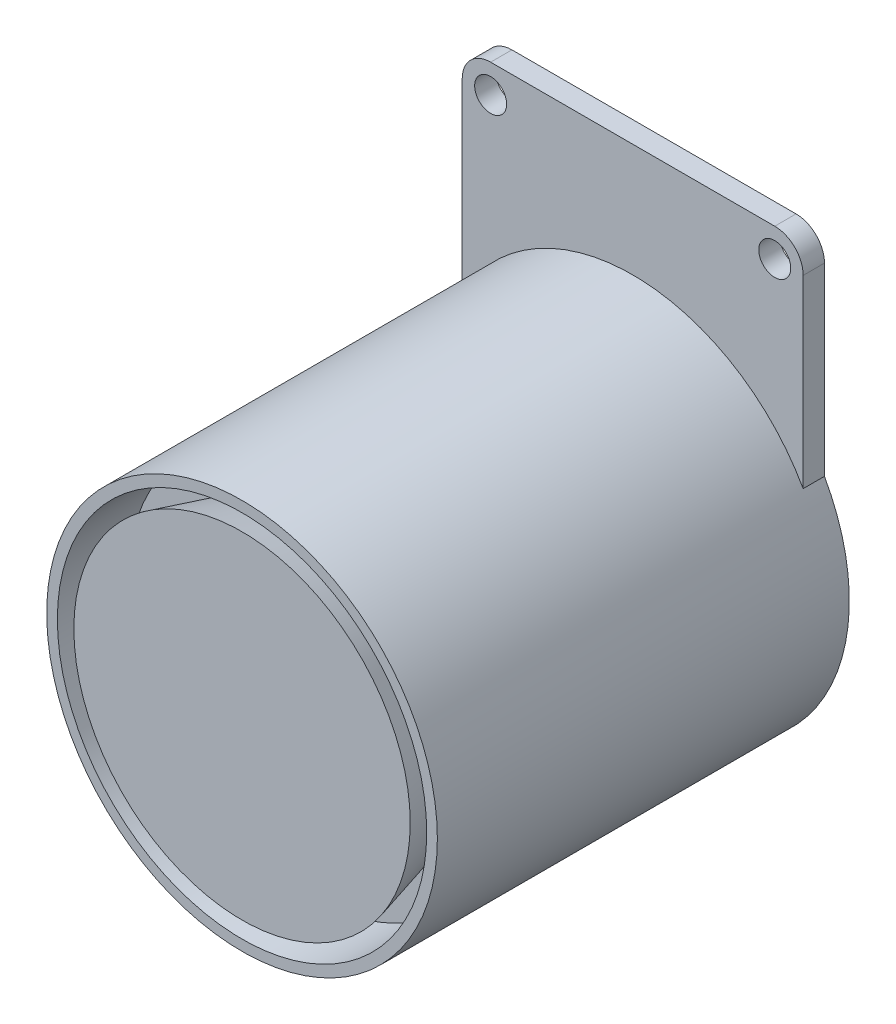
ISO-10303-21;
HEADER;
FILE_DESCRIPTION(('STEP AP214'),'2;1');
FILE_NAME('part.step','',(''),(''),'','','');
FILE_SCHEMA(('AUTOMOTIVE_DESIGN { 1 0 10303 214 1 1 1 1 }'));
ENDSEC;
DATA;
#1=APPLICATION_CONTEXT('core data for automotive mechanical design processes');
#2=APPLICATION_PROTOCOL_DEFINITION('international standard','automotive_design',2000,#1);
#3=PRODUCT_CONTEXT('',#1,'mechanical');
#4=PRODUCT('Part','Part','',(#3));
#5=PRODUCT_RELATED_PRODUCT_CATEGORY('part','',(#4));
#6=PRODUCT_DEFINITION_FORMATION('','',#4);
#7=PRODUCT_DEFINITION_CONTEXT('part definition',#1,'design');
#8=PRODUCT_DEFINITION('design','',#6,#7);
#9=PRODUCT_DEFINITION_SHAPE('','',#8);
#10=(LENGTH_UNIT() NAMED_UNIT(*) SI_UNIT(.MILLI.,.METRE.));
#11=(NAMED_UNIT(*) PLANE_ANGLE_UNIT() SI_UNIT($,.RADIAN.));
#12=(NAMED_UNIT(*) SI_UNIT($,.STERADIAN.) SOLID_ANGLE_UNIT());
#13=UNCERTAINTY_MEASURE_WITH_UNIT(LENGTH_MEASURE(1.E-05),#10,'distance_accuracy_value','');
#14=(GEOMETRIC_REPRESENTATION_CONTEXT(3) GLOBAL_UNCERTAINTY_ASSIGNED_CONTEXT((#13)) GLOBAL_UNIT_ASSIGNED_CONTEXT((#10,
#11,#12)) REPRESENTATION_CONTEXT('',''));
#15=CARTESIAN_POINT('',(0.,0.,0.));
#16=DIRECTION('',(0.,0.,1.));
#17=DIRECTION('',(1.,0.,0.));
#18=AXIS2_PLACEMENT_3D('',#15,#16,#17);
#19=CARTESIAN_POINT('',(0.,0.,3.));
#20=DIRECTION('',(0.,0.,-1.));
#21=DIRECTION('',(-1.,0.,0.));
#22=AXIS2_PLACEMENT_3D('',#19,#20,#21);
#23=PLANE('',#22);
#24=CARTESIAN_POINT('',(-20.,39.4257215820975,3.));
#25=DIRECTION('',(0.,0.,1.));
#26=DIRECTION('',(1.,0.,0.));
#27=AXIS2_PLACEMENT_3D('',#24,#25,#26);
#28=CIRCLE('',#27,2.25);
#29=CARTESIAN_POINT('',(-17.75,39.4257215820975,3.));
#30=VERTEX_POINT('',#29);
#31=EDGE_CURVE('E214',#30,#30,#28,.T.);
#32=ORIENTED_EDGE('',*,*,#31,.F.);
#33=EDGE_LOOP('',(#32));
#34=FACE_BOUND('',#33,.T.);
#35=CARTESIAN_POINT('',(20.,39.4257215820975,3.));
#36=DIRECTION('',(0.,0.,1.));
#37=DIRECTION('',(1.,0.,0.));
#38=AXIS2_PLACEMENT_3D('',#35,#36,#37);
#39=CIRCLE('',#38,2.25);
#40=CARTESIAN_POINT('',(22.25,39.4257215820975,3.));
#41=VERTEX_POINT('',#40);
#42=EDGE_CURVE('E204',#41,#41,#39,.T.);
#43=ORIENTED_EDGE('',*,*,#42,.F.);
#44=EDGE_LOOP('',(#43));
#45=FACE_BOUND('',#44,.T.);
#46=DIRECTION('',(0.,1.,0.));
#47=VECTOR('',#46,1.);
#48=CARTESIAN_POINT('',(24.,13.4257215820976,3.));
#49=LINE('',#48,#47);
#50=CARTESIAN_POINT('',(24.,13.4257215820976,3.));
#51=VERTEX_POINT('',#50);
#52=CARTESIAN_POINT('',(24.,39.4257215820975,3.));
#53=VERTEX_POINT('',#52);
#54=EDGE_CURVE('E104',#51,#53,#49,.T.);
#55=ORIENTED_EDGE('',*,*,#54,.T.);
#56=CARTESIAN_POINT('',(20.,39.4257215820975,3.));
#57=DIRECTION('',(0.,0.,-1.));
#58=DIRECTION('',(-1.,0.,0.));
#59=AXIS2_PLACEMENT_3D('',#56,#57,#58);
#60=CIRCLE('',#59,4.);
#61=CARTESIAN_POINT('',(20.,43.4257215820976,3.));
#62=VERTEX_POINT('',#61);
#63=EDGE_CURVE('E59',#53,#62,#60,.F.);
#64=ORIENTED_EDGE('',*,*,#63,.T.);
#65=DIRECTION('',(1.,0.,0.));
#66=VECTOR('',#65,1.);
#67=CARTESIAN_POINT('',(-24.,43.4257215820976,3.));
#68=LINE('',#67,#66);
#69=CARTESIAN_POINT('',(-20.,43.4257215820976,3.));
#70=VERTEX_POINT('',#69);
#71=EDGE_CURVE('E111',#70,#62,#68,.T.);
#72=ORIENTED_EDGE('',*,*,#71,.F.);
#73=CARTESIAN_POINT('',(-20.,39.4257215820975,3.));
#74=DIRECTION('',(0.,0.,-1.));
#75=DIRECTION('',(-1.,0.,0.));
#76=AXIS2_PLACEMENT_3D('',#73,#74,#75);
#77=CIRCLE('',#76,4.);
#78=CARTESIAN_POINT('',(-24.,39.4257215820975,3.));
#79=VERTEX_POINT('',#78);
#80=EDGE_CURVE('E66',#70,#79,#77,.F.);
#81=ORIENTED_EDGE('',*,*,#80,.T.);
#82=DIRECTION('',(0.,1.,0.));
#83=VECTOR('',#82,1.);
#84=CARTESIAN_POINT('',(-24.,13.4257215820975,3.));
#85=LINE('',#84,#83);
#86=CARTESIAN_POINT('',(-24.,13.4257215820975,3.));
#87=VERTEX_POINT('',#86);
#88=EDGE_CURVE('E123',#87,#79,#85,.T.);
#89=ORIENTED_EDGE('',*,*,#88,.F.);
#90=CARTESIAN_POINT('',(0.,0.,3.));
#91=DIRECTION('',(0.,0.,1.));
#92=DIRECTION('',(1.,0.,0.));
#93=AXIS2_PLACEMENT_3D('',#90,#91,#92);
#94=CIRCLE('',#93,27.5);
#95=EDGE_CURVE('E117',#51,#87,#94,.T.);
#96=ORIENTED_EDGE('',*,*,#95,.F.);
#97=EDGE_LOOP('',(#55,#64,#72,#81,#89,#96));
#98=FACE_BOUND('',#97,.T.);
#99=ADVANCED_FACE('F51',(#34,#45,#98),#23,.F.);
#100=CARTESIAN_POINT('',(-24.,43.4257215820976,3.));
#101=DIRECTION('',(0.,1.,0.));
#102=DIRECTION('',(0.,0.,1.));
#103=AXIS2_PLACEMENT_3D('',#100,#101,#102);
#104=PLANE('',#103);
#105=ORIENTED_EDGE('',*,*,#71,.T.);
#106=DIRECTION('',(0.,0.,-1.));
#107=VECTOR('',#106,1.);
#108=CARTESIAN_POINT('',(20.,43.4257215820976,0.));
#109=LINE('',#108,#107);
#110=CARTESIAN_POINT('',(20.,43.4257215820976,0.));
#111=VERTEX_POINT('',#110);
#112=EDGE_CURVE('E149',#62,#111,#109,.T.);
#113=ORIENTED_EDGE('',*,*,#112,.T.);
#114=DIRECTION('',(1.,0.,0.));
#115=VECTOR('',#114,1.);
#116=CARTESIAN_POINT('',(-24.,43.4257215820976,0.));
#117=LINE('',#116,#115);
#118=CARTESIAN_POINT('',(-20.,43.4257215820976,0.));
#119=VERTEX_POINT('',#118);
#120=EDGE_CURVE('E141',#119,#111,#117,.T.);
#121=ORIENTED_EDGE('',*,*,#120,.F.);
#122=DIRECTION('',(0.,0.,-1.));
#123=VECTOR('',#122,1.);
#124=CARTESIAN_POINT('',(-20.,43.4257215820976,3.));
#125=LINE('',#124,#123);
#126=EDGE_CURVE('E145',#119,#70,#125,.F.);
#127=ORIENTED_EDGE('',*,*,#126,.T.);
#128=EDGE_LOOP('',(#105,#113,#121,#127));
#129=FACE_BOUND('',#128,.T.);
#130=ADVANCED_FACE('F160',(#129),#104,.T.);
#131=CARTESIAN_POINT('',(-24.,13.4257215820975,3.));
#132=DIRECTION('',(-1.,0.,0.));
#133=DIRECTION('',(0.,0.,1.));
#134=AXIS2_PLACEMENT_3D('',#131,#132,#133);
#135=PLANE('',#134);
#136=ORIENTED_EDGE('',*,*,#88,.T.);
#137=DIRECTION('',(0.,0.,-1.));
#138=VECTOR('',#137,1.);
#139=CARTESIAN_POINT('',(-24.,39.4257215820975,3.));
#140=LINE('',#139,#138);
#141=CARTESIAN_POINT('',(-24.,39.4257215820975,0.));
#142=VERTEX_POINT('',#141);
#143=EDGE_CURVE('E12',#79,#142,#140,.T.);
#144=ORIENTED_EDGE('',*,*,#143,.T.);
#145=DIRECTION('',(0.,1.,0.));
#146=VECTOR('',#145,1.);
#147=CARTESIAN_POINT('',(-24.,13.4257215820975,0.));
#148=LINE('',#147,#146);
#149=CARTESIAN_POINT('',(-24.,13.4257215820975,0.));
#150=VERTEX_POINT('',#149);
#151=EDGE_CURVE('E138',#150,#142,#148,.T.);
#152=ORIENTED_EDGE('',*,*,#151,.F.);
#153=DIRECTION('',(0.,0.,-1.));
#154=VECTOR('',#153,1.);
#155=CARTESIAN_POINT('',(-24.,13.4257215820975,3.));
#156=LINE('',#155,#154);
#157=EDGE_CURVE('E121',#87,#150,#156,.T.);
#158=ORIENTED_EDGE('',*,*,#157,.F.);
#159=EDGE_LOOP('',(#136,#144,#152,#158));
#160=FACE_BOUND('',#159,.T.);
#161=ADVANCED_FACE('F170',(#160),#135,.T.);
#162=CARTESIAN_POINT('',(24.,13.4257215820976,3.));
#163=DIRECTION('',(-1.,0.,0.));
#164=DIRECTION('',(0.,0.,1.));
#165=AXIS2_PLACEMENT_3D('',#162,#163,#164);
#166=PLANE('',#165);
#167=DIRECTION('',(0.,1.,0.));
#168=VECTOR('',#167,1.);
#169=CARTESIAN_POINT('',(24.,13.4257215820976,0.));
#170=LINE('',#169,#168);
#171=CARTESIAN_POINT('',(24.,13.4257215820976,0.));
#172=VERTEX_POINT('',#171);
#173=CARTESIAN_POINT('',(24.,39.4257215820975,0.));
#174=VERTEX_POINT('',#173);
#175=EDGE_CURVE('E135',#172,#174,#170,.T.);
#176=ORIENTED_EDGE('',*,*,#175,.T.);
#177=DIRECTION('',(0.,0.,-1.));
#178=VECTOR('',#177,1.);
#179=CARTESIAN_POINT('',(24.,39.4257215820975,3.));
#180=LINE('',#179,#178);
#181=EDGE_CURVE('E74',#174,#53,#180,.F.);
#182=ORIENTED_EDGE('',*,*,#181,.T.);
#183=ORIENTED_EDGE('',*,*,#54,.F.);
#184=DIRECTION('',(0.,0.,-1.));
#185=VECTOR('',#184,1.);
#186=CARTESIAN_POINT('',(24.,13.4257215820976,3.));
#187=LINE('',#186,#185);
#188=EDGE_CURVE('E107',#51,#172,#187,.T.);
#189=ORIENTED_EDGE('',*,*,#188,.T.);
#190=EDGE_LOOP('',(#176,#182,#183,#189));
#191=FACE_BOUND('',#190,.T.);
#192=ADVANCED_FACE('F106',(#191),#166,.F.);
#193=CARTESIAN_POINT('',(0.,0.,0.));
#194=DIRECTION('',(0.,0.,-1.));
#195=DIRECTION('',(-1.,0.,0.));
#196=AXIS2_PLACEMENT_3D('',#193,#194,#195);
#197=PLANE('',#196);
#198=CARTESIAN_POINT('',(-20.,39.4257215820975,0.));
#199=DIRECTION('',(0.,0.,-1.));
#200=DIRECTION('',(-1.,0.,0.));
#201=AXIS2_PLACEMENT_3D('',#198,#199,#200);
#202=CIRCLE('',#201,2.25);
#203=CARTESIAN_POINT('',(-22.25,39.4257215820975,0.));
#204=VERTEX_POINT('',#203);
#205=EDGE_CURVE('E199',#204,#204,#202,.F.);
#206=ORIENTED_EDGE('',*,*,#205,.T.);
#207=EDGE_LOOP('',(#206));
#208=FACE_BOUND('',#207,.T.);
#209=CARTESIAN_POINT('',(20.,39.4257215820975,0.));
#210=DIRECTION('',(0.,0.,-1.));
#211=DIRECTION('',(-1.,0.,0.));
#212=AXIS2_PLACEMENT_3D('',#209,#210,#211);
#213=CIRCLE('',#212,2.25);
#214=CARTESIAN_POINT('',(17.75,39.4257215820975,0.));
#215=VERTEX_POINT('',#214);
#216=EDGE_CURVE('E202',#215,#215,#213,.F.);
#217=ORIENTED_EDGE('',*,*,#216,.T.);
#218=EDGE_LOOP('',(#217));
#219=FACE_BOUND('',#218,.T.);
#220=ORIENTED_EDGE('',*,*,#120,.T.);
#221=CARTESIAN_POINT('',(20.,39.4257215820975,0.));
#222=DIRECTION('',(0.,0.,-1.));
#223=DIRECTION('',(-1.,0.,0.));
#224=AXIS2_PLACEMENT_3D('',#221,#222,#223);
#225=CIRCLE('',#224,4.);
#226=EDGE_CURVE('E154',#111,#174,#225,.T.);
#227=ORIENTED_EDGE('',*,*,#226,.T.);
#228=ORIENTED_EDGE('',*,*,#175,.F.);
#229=CARTESIAN_POINT('',(0.,0.,0.));
#230=DIRECTION('',(0.,0.,1.));
#231=DIRECTION('',(1.,0.,0.));
#232=AXIS2_PLACEMENT_3D('',#229,#230,#231);
#233=CIRCLE('',#232,27.5);
#234=EDGE_CURVE('E119',#150,#172,#233,.T.);
#235=ORIENTED_EDGE('',*,*,#234,.F.);
#236=ORIENTED_EDGE('',*,*,#151,.T.);
#237=CARTESIAN_POINT('',(-20.,39.4257215820975,0.));
#238=DIRECTION('',(0.,0.,-1.));
#239=DIRECTION('',(-1.,0.,0.));
#240=AXIS2_PLACEMENT_3D('',#237,#238,#239);
#241=CIRCLE('',#240,4.);
#242=EDGE_CURVE('E152',#142,#119,#241,.T.);
#243=ORIENTED_EDGE('',*,*,#242,.T.);
#244=EDGE_LOOP('',(#220,#227,#228,#235,#236,#243));
#245=FACE_BOUND('',#244,.T.);
#246=ADVANCED_FACE('F165',(#208,#219,#245),#197,.T.);
#247=CARTESIAN_POINT('',(0.,0.,3.));
#248=DIRECTION('',(0.,0.,-1.));
#249=DIRECTION('',(-1.,0.,0.));
#250=AXIS2_PLACEMENT_3D('',#247,#248,#249);
#251=CYLINDRICAL_SURFACE('',#250,27.5);
#252=ORIENTED_EDGE('',*,*,#188,.F.);
#253=ORIENTED_EDGE('',*,*,#95,.T.);
#254=ORIENTED_EDGE('',*,*,#157,.T.);
#255=ORIENTED_EDGE('',*,*,#234,.T.);
#256=EDGE_LOOP('',(#252,#253,#254,#255));
#257=FACE_BOUND('',#256,.T.);
#258=CARTESIAN_POINT('',(0.,0.,58.));
#259=DIRECTION('',(0.,0.,1.));
#260=DIRECTION('',(1.,0.,0.));
#261=AXIS2_PLACEMENT_3D('',#258,#259,#260);
#262=CIRCLE('',#261,27.5);
#263=CARTESIAN_POINT('',(27.5,0.,58.));
#264=VERTEX_POINT('',#263);
#265=EDGE_CURVE('E124',#264,#264,#262,.T.);
#266=ORIENTED_EDGE('',*,*,#265,.F.);
#267=EDGE_LOOP('',(#266));
#268=FACE_BOUND('',#267,.T.);
#269=ADVANCED_FACE('F115',(#257,#268),#251,.T.);
#270=CARTESIAN_POINT('',(0.,0.,58.));
#271=DIRECTION('',(0.,0.,1.));
#272=DIRECTION('',(1.,0.,0.));
#273=AXIS2_PLACEMENT_3D('',#270,#271,#272);
#274=PLANE('',#273);
#275=CARTESIAN_POINT('',(0.,0.,58.));
#276=DIRECTION('',(0.,0.,1.));
#277=DIRECTION('',(1.,0.,0.));
#278=AXIS2_PLACEMENT_3D('',#275,#276,#277);
#279=CIRCLE('',#278,26.);
#280=CARTESIAN_POINT('',(26.,0.,58.));
#281=VERTEX_POINT('',#280);
#282=EDGE_CURVE('E130',#281,#281,#279,.T.);
#283=ORIENTED_EDGE('',*,*,#282,.F.);
#284=EDGE_LOOP('',(#283));
#285=FACE_BOUND('',#284,.T.);
#286=ORIENTED_EDGE('',*,*,#265,.T.);
#287=EDGE_LOOP('',(#286));
#288=FACE_BOUND('',#287,.T.);
#289=ADVANCED_FACE('F189',(#285,#288),#274,.T.);
#290=CARTESIAN_POINT('',(0.,0.,48.));
#291=DIRECTION('',(0.,0.,1.));
#292=DIRECTION('',(1.,0.,0.));
#293=AXIS2_PLACEMENT_3D('',#290,#291,#292);
#294=CYLINDRICAL_SURFACE('',#293,26.);
#295=CARTESIAN_POINT('',(0.,0.,48.));
#296=DIRECTION('',(0.,0.,1.));
#297=DIRECTION('',(1.,0.,0.));
#298=AXIS2_PLACEMENT_3D('',#295,#296,#297);
#299=CIRCLE('',#298,26.);
#300=CARTESIAN_POINT('',(26.,0.,48.));
#301=VERTEX_POINT('',#300);
#302=EDGE_CURVE('E125',#301,#301,#299,.T.);
#303=ORIENTED_EDGE('',*,*,#302,.F.);
#304=EDGE_LOOP('',(#303));
#305=FACE_BOUND('',#304,.T.);
#306=ORIENTED_EDGE('',*,*,#282,.T.);
#307=EDGE_LOOP('',(#306));
#308=FACE_BOUND('',#307,.T.);
#309=ADVANCED_FACE('F219',(#305,#308),#294,.F.);
#310=CARTESIAN_POINT('',(0.,0.,48.));
#311=DIRECTION('',(0.,0.,1.));
#312=DIRECTION('',(1.,0.,0.));
#313=AXIS2_PLACEMENT_3D('',#310,#311,#312);
#314=PLANE('',#313);
#315=CARTESIAN_POINT('',(0.,0.,48.));
#316=DIRECTION('',(0.,0.,1.));
#317=DIRECTION('',(1.,0.,0.));
#318=AXIS2_PLACEMENT_3D('',#315,#316,#317);
#319=CIRCLE('',#318,21.);
#320=CARTESIAN_POINT('',(21.,0.,48.));
#321=VERTEX_POINT('',#320);
#322=EDGE_CURVE('E210',#321,#321,#319,.T.);
#323=ORIENTED_EDGE('',*,*,#322,.F.);
#324=EDGE_LOOP('',(#323));
#325=FACE_BOUND('',#324,.T.);
#326=ORIENTED_EDGE('',*,*,#302,.T.);
#327=EDGE_LOOP('',(#326));
#328=FACE_BOUND('',#327,.T.);
#329=ADVANCED_FACE('F227',(#325,#328),#314,.T.);
#330=CARTESIAN_POINT('',(0.,0.,48.));
#331=DIRECTION('',(0.,0.,1.));
#332=DIRECTION('',(1.,0.,0.));
#333=AXIS2_PLACEMENT_3D('',#330,#331,#332);
#334=CONICAL_SURFACE('',#333,21.,0.26179938779915);
#335=CARTESIAN_POINT('',(0.,0.,58.));
#336=DIRECTION('',(0.,0.,1.));
#337=DIRECTION('',(1.,0.,0.));
#338=AXIS2_PLACEMENT_3D('',#335,#336,#337);
#339=CIRCLE('',#338,23.6794919243112);
#340=CARTESIAN_POINT('',(23.6794919243112,0.,58.));
#341=VERTEX_POINT('',#340);
#342=EDGE_CURVE('E213',#341,#341,#339,.T.);
#343=ORIENTED_EDGE('',*,*,#342,.F.);
#344=EDGE_LOOP('',(#343));
#345=FACE_BOUND('',#344,.T.);
#346=ORIENTED_EDGE('',*,*,#322,.T.);
#347=EDGE_LOOP('',(#346));
#348=FACE_BOUND('',#347,.T.);
#349=ADVANCED_FACE('F232',(#345,#348),#334,.T.);
#350=CARTESIAN_POINT('',(0.,0.,58.));
#351=DIRECTION('',(0.,0.,1.));
#352=DIRECTION('',(1.,0.,0.));
#353=AXIS2_PLACEMENT_3D('',#350,#351,#352);
#354=PLANE('',#353);
#355=ORIENTED_EDGE('',*,*,#342,.T.);
#356=EDGE_LOOP('',(#355));
#357=FACE_BOUND('',#356,.T.);
#358=ADVANCED_FACE('F239',(#357),#354,.T.);
#359=CARTESIAN_POINT('',(20.,39.4257215820975,-0.00100000000000013));
#360=DIRECTION('',(0.,0.,1.));
#361=DIRECTION('',(1.,0.,0.));
#362=AXIS2_PLACEMENT_3D('',#359,#360,#361);
#363=CYLINDRICAL_SURFACE('',#362,2.25);
#364=ORIENTED_EDGE('',*,*,#216,.F.);
#365=EDGE_LOOP('',(#364));
#366=FACE_BOUND('',#365,.T.);
#367=ORIENTED_EDGE('',*,*,#42,.T.);
#368=EDGE_LOOP('',(#367));
#369=FACE_BOUND('',#368,.T.);
#370=ADVANCED_FACE('F243',(#366,#369),#363,.F.);
#371=CARTESIAN_POINT('',(-20.,39.4257215820975,-0.00100000000000013));
#372=DIRECTION('',(0.,0.,1.));
#373=DIRECTION('',(1.,0.,0.));
#374=AXIS2_PLACEMENT_3D('',#371,#372,#373);
#375=CYLINDRICAL_SURFACE('',#374,2.25);
#376=ORIENTED_EDGE('',*,*,#205,.F.);
#377=EDGE_LOOP('',(#376));
#378=FACE_BOUND('',#377,.T.);
#379=ORIENTED_EDGE('',*,*,#31,.T.);
#380=EDGE_LOOP('',(#379));
#381=FACE_BOUND('',#380,.T.);
#382=ADVANCED_FACE('F247',(#378,#381),#375,.F.);
#383=CARTESIAN_POINT('',(20.,39.4257215820975,3.));
#384=DIRECTION('',(0.,0.,1.));
#385=DIRECTION('',(1.,0.,0.));
#386=AXIS2_PLACEMENT_3D('',#383,#384,#385);
#387=CYLINDRICAL_SURFACE('',#386,4.);
#388=ORIENTED_EDGE('',*,*,#63,.F.);
#389=ORIENTED_EDGE('',*,*,#181,.F.);
#390=ORIENTED_EDGE('',*,*,#226,.F.);
#391=ORIENTED_EDGE('',*,*,#112,.F.);
#392=EDGE_LOOP('',(#388,#389,#390,#391));
#393=FACE_BOUND('',#392,.T.);
#394=ADVANCED_FACE('F163',(#393),#387,.T.);
#395=CARTESIAN_POINT('',(-20.,39.4257215820975,3.));
#396=DIRECTION('',(0.,0.,-1.));
#397=DIRECTION('',(-1.,0.,0.));
#398=AXIS2_PLACEMENT_3D('',#395,#396,#397);
#399=CYLINDRICAL_SURFACE('',#398,4.);
#400=ORIENTED_EDGE('',*,*,#80,.F.);
#401=ORIENTED_EDGE('',*,*,#126,.F.);
#402=ORIENTED_EDGE('',*,*,#242,.F.);
#403=ORIENTED_EDGE('',*,*,#143,.F.);
#404=EDGE_LOOP('',(#400,#401,#402,#403));
#405=FACE_BOUND('',#404,.T.);
#406=ADVANCED_FACE('F53',(#405),#399,.T.);
#407=CLOSED_SHELL('',(#99,#130,#161,#192,#246,#269,#289,#309,#329,#349,#358,#370,#382,#394,#406));
#408=MANIFOLD_SOLID_BREP('B2',#407);
#409=ADVANCED_BREP_SHAPE_REPRESENTATION('',(#18,#408),#14);
#410=SHAPE_DEFINITION_REPRESENTATION(#9,#409);
ENDSEC;
END-ISO-10303-21;
